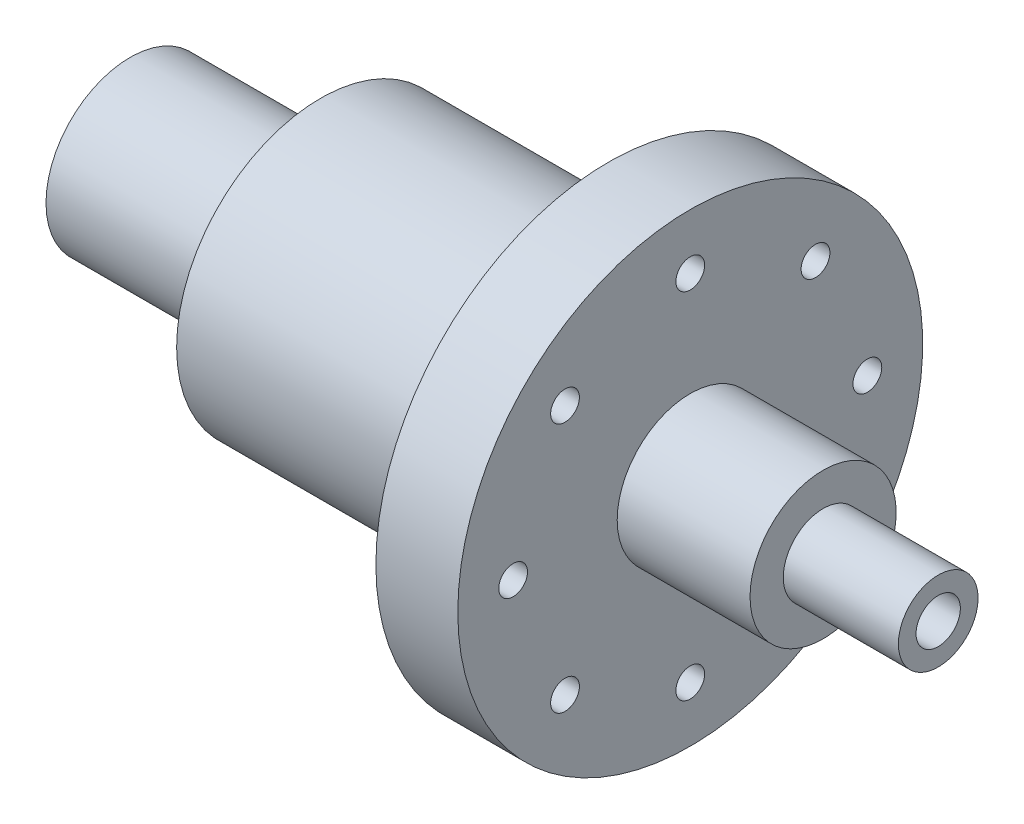
ISO-10303-21;
HEADER;
FILE_DESCRIPTION(('STEP AP214'),'2;1');
FILE_NAME('part.step','',(''),(''),'','','');
FILE_SCHEMA(('AUTOMOTIVE_DESIGN { 1 0 10303 214 1 1 1 1 }'));
ENDSEC;
DATA;
#1=APPLICATION_CONTEXT('core data for automotive mechanical design processes');
#2=APPLICATION_PROTOCOL_DEFINITION('international standard','automotive_design',2000,#1);
#3=PRODUCT_CONTEXT('',#1,'mechanical');
#4=PRODUCT('Part','Part','',(#3));
#5=PRODUCT_RELATED_PRODUCT_CATEGORY('part','',(#4));
#6=PRODUCT_DEFINITION_FORMATION('','',#4);
#7=PRODUCT_DEFINITION_CONTEXT('part definition',#1,'design');
#8=PRODUCT_DEFINITION('design','',#6,#7);
#9=PRODUCT_DEFINITION_SHAPE('','',#8);
#10=(LENGTH_UNIT() NAMED_UNIT(*) SI_UNIT(.MILLI.,.METRE.));
#11=(NAMED_UNIT(*) PLANE_ANGLE_UNIT() SI_UNIT($,.RADIAN.));
#12=(NAMED_UNIT(*) SI_UNIT($,.STERADIAN.) SOLID_ANGLE_UNIT());
#13=UNCERTAINTY_MEASURE_WITH_UNIT(LENGTH_MEASURE(1.E-05),#10,'distance_accuracy_value','');
#14=(GEOMETRIC_REPRESENTATION_CONTEXT(3) GLOBAL_UNCERTAINTY_ASSIGNED_CONTEXT((#13)) GLOBAL_UNIT_ASSIGNED_CONTEXT((#10,
#11,#12)) REPRESENTATION_CONTEXT('',''));
#15=CARTESIAN_POINT('',(0.,0.,0.));
#16=DIRECTION('',(0.,0.,1.));
#17=DIRECTION('',(1.,0.,0.));
#18=AXIS2_PLACEMENT_3D('',#15,#16,#17);
#19=CARTESIAN_POINT('',(-194.06956615453,0.,0.));
#20=DIRECTION('',(-1.,0.,0.));
#21=DIRECTION('',(0.,0.,1.));
#22=AXIS2_PLACEMENT_3D('',#19,#20,#21);
#23=CYLINDRICAL_SURFACE('',#22,9.99999999999998);
#24=CARTESIAN_POINT('',(182.5,0.,0.));
#25=DIRECTION('',(-1.,0.,0.));
#26=DIRECTION('',(0.,0.,1.));
#27=AXIS2_PLACEMENT_3D('',#24,#25,#26);
#28=CIRCLE('',#27,9.99999999999998);
#29=CARTESIAN_POINT('',(182.5,0.,9.99999999999998));
#30=VERTEX_POINT('',#29);
#31=EDGE_CURVE('E87',#30,#30,#28,.T.);
#32=ORIENTED_EDGE('',*,*,#31,.F.);
#33=EDGE_LOOP('',(#32));
#34=FACE_BOUND('',#33,.T.);
#35=CARTESIAN_POINT('',(-182.5,0.,0.));
#36=DIRECTION('',(-1.,0.,0.));
#37=DIRECTION('',(0.,0.,1.));
#38=AXIS2_PLACEMENT_3D('',#35,#36,#37);
#39=CIRCLE('',#38,9.99999999999998);
#40=CARTESIAN_POINT('',(-182.5,0.,9.99999999999998));
#41=VERTEX_POINT('',#40);
#42=EDGE_CURVE('E12',#41,#41,#39,.T.);
#43=ORIENTED_EDGE('',*,*,#42,.T.);
#44=EDGE_LOOP('',(#43));
#45=FACE_BOUND('',#44,.T.);
#46=ADVANCED_FACE('F47',(#34,#45),#23,.F.);
#47=CARTESIAN_POINT('',(-182.5,9.99999999999998,0.));
#48=DIRECTION('',(1.,0.,0.));
#49=DIRECTION('',(0.,0.,-1.));
#50=AXIS2_PLACEMENT_3D('',#47,#48,#49);
#51=PLANE('',#50);
#52=ORIENTED_EDGE('',*,*,#42,.F.);
#53=EDGE_LOOP('',(#52));
#54=FACE_BOUND('',#53,.T.);
#55=CARTESIAN_POINT('',(-182.5,0.,0.));
#56=DIRECTION('',(-1.,0.,0.));
#57=DIRECTION('',(0.,0.,1.));
#58=AXIS2_PLACEMENT_3D('',#55,#56,#57);
#59=CIRCLE('',#58,38.);
#60=CARTESIAN_POINT('',(-182.5,0.,38.));
#61=VERTEX_POINT('',#60);
#62=EDGE_CURVE('E53',#61,#61,#59,.T.);
#63=ORIENTED_EDGE('',*,*,#62,.T.);
#64=EDGE_LOOP('',(#63));
#65=FACE_BOUND('',#64,.T.);
#66=ADVANCED_FACE('F191',(#54,#65),#51,.F.);
#67=CARTESIAN_POINT('',(-194.06956615453,0.,0.));
#68=DIRECTION('',(-1.,0.,0.));
#69=DIRECTION('',(0.,0.,1.));
#70=AXIS2_PLACEMENT_3D('',#67,#68,#69);
#71=CYLINDRICAL_SURFACE('',#70,38.);
#72=ORIENTED_EDGE('',*,*,#62,.F.);
#73=EDGE_LOOP('',(#72));
#74=FACE_BOUND('',#73,.T.);
#75=CARTESIAN_POINT('',(-96.5,0.,0.));
#76=DIRECTION('',(-1.,0.,0.));
#77=DIRECTION('',(0.,0.,1.));
#78=AXIS2_PLACEMENT_3D('',#75,#76,#77);
#79=CIRCLE('',#78,38.);
#80=CARTESIAN_POINT('',(-96.5,0.,38.));
#81=VERTEX_POINT('',#80);
#82=EDGE_CURVE('E57',#81,#81,#79,.T.);
#83=ORIENTED_EDGE('',*,*,#82,.T.);
#84=EDGE_LOOP('',(#83));
#85=FACE_BOUND('',#84,.T.);
#86=ADVANCED_FACE('F195',(#74,#85),#71,.T.);
#87=CARTESIAN_POINT('',(-96.5,38.,0.));
#88=DIRECTION('',(1.,0.,0.));
#89=DIRECTION('',(0.,0.,-1.));
#90=AXIS2_PLACEMENT_3D('',#87,#88,#89);
#91=PLANE('',#90);
#92=ORIENTED_EDGE('',*,*,#82,.F.);
#93=EDGE_LOOP('',(#92));
#94=FACE_BOUND('',#93,.T.);
#95=CARTESIAN_POINT('',(-96.5,0.,0.));
#96=DIRECTION('',(-1.,0.,0.));
#97=DIRECTION('',(0.,0.,1.));
#98=AXIS2_PLACEMENT_3D('',#95,#96,#97);
#99=CIRCLE('',#98,65.);
#100=CARTESIAN_POINT('',(-96.5,0.,65.));
#101=VERTEX_POINT('',#100);
#102=EDGE_CURVE('E61',#101,#101,#99,.T.);
#103=ORIENTED_EDGE('',*,*,#102,.T.);
#104=EDGE_LOOP('',(#103));
#105=FACE_BOUND('',#104,.T.);
#106=ADVANCED_FACE('F200',(#94,#105),#91,.F.);
#107=CARTESIAN_POINT('',(-194.06956615453,0.,0.));
#108=DIRECTION('',(-1.,0.,0.));
#109=DIRECTION('',(0.,0.,1.));
#110=AXIS2_PLACEMENT_3D('',#107,#108,#109);
#111=CYLINDRICAL_SURFACE('',#110,65.);
#112=ORIENTED_EDGE('',*,*,#102,.F.);
#113=EDGE_LOOP('',(#112));
#114=FACE_BOUND('',#113,.T.);
#115=CARTESIAN_POINT('',(33.5,0.,0.));
#116=DIRECTION('',(-1.,0.,0.));
#117=DIRECTION('',(0.,0.,1.));
#118=AXIS2_PLACEMENT_3D('',#115,#116,#117);
#119=CIRCLE('',#118,65.);
#120=CARTESIAN_POINT('',(33.5,0.,65.));
#121=VERTEX_POINT('',#120);
#122=EDGE_CURVE('E66',#121,#121,#119,.T.);
#123=ORIENTED_EDGE('',*,*,#122,.T.);
#124=EDGE_LOOP('',(#123));
#125=FACE_BOUND('',#124,.T.);
#126=ADVANCED_FACE('F206',(#114,#125),#111,.T.);
#127=CARTESIAN_POINT('',(33.5,65.,0.));
#128=DIRECTION('',(1.,0.,0.));
#129=DIRECTION('',(0.,0.,-1.));
#130=AXIS2_PLACEMENT_3D('',#127,#128,#129);
#131=PLANE('',#130);
#132=CARTESIAN_POINT('',(33.5,80.,-1.46726526693321E-12));
#133=DIRECTION('',(1.,0.,0.));
#134=DIRECTION('',(0.,0.,-1.));
#135=AXIS2_PLACEMENT_3D('',#132,#133,#134);
#136=CIRCLE('',#135,6.5);
#137=CARTESIAN_POINT('',(33.5,80.,-6.50000000000147));
#138=VERTEX_POINT('',#137);
#139=EDGE_CURVE('E90',#138,#138,#136,.T.);
#140=ORIENTED_EDGE('',*,*,#139,.T.);
#141=EDGE_LOOP('',(#140));
#142=FACE_BOUND('',#141,.T.);
#143=CARTESIAN_POINT('',(33.5,56.5685424949262,-56.5685424949263));
#144=DIRECTION('',(1.,0.,0.));
#145=DIRECTION('',(0.,0.,-1.));
#146=AXIS2_PLACEMENT_3D('',#143,#144,#145);
#147=CIRCLE('',#146,6.5);
#148=CARTESIAN_POINT('',(33.5,56.5685424949262,-63.0685424949263));
#149=VERTEX_POINT('',#148);
#150=EDGE_CURVE('E93',#149,#149,#147,.T.);
#151=ORIENTED_EDGE('',*,*,#150,.T.);
#152=EDGE_LOOP('',(#151));
#153=FACE_BOUND('',#152,.T.);
#154=CARTESIAN_POINT('',(33.5,3.4008079572553E-12,-80.0000000000049));
#155=DIRECTION('',(1.,0.,0.));
#156=DIRECTION('',(0.,0.,-1.));
#157=AXIS2_PLACEMENT_3D('',#154,#155,#156);
#158=CIRCLE('',#157,6.5);
#159=CARTESIAN_POINT('',(33.5,3.4008079572553E-12,-86.5000000000049));
#160=VERTEX_POINT('',#159);
#161=EDGE_CURVE('E96',#160,#160,#158,.T.);
#162=ORIENTED_EDGE('',*,*,#161,.T.);
#163=EDGE_LOOP('',(#162));
#164=FACE_BOUND('',#163,.T.);
#165=CARTESIAN_POINT('',(33.5,-56.5685424949214,-56.5685424949311));
#166=DIRECTION('',(1.,0.,0.));
#167=DIRECTION('',(0.,0.,-1.));
#168=AXIS2_PLACEMENT_3D('',#165,#166,#167);
#169=CIRCLE('',#168,6.5);
#170=CARTESIAN_POINT('',(33.5,-56.5685424949214,-63.0685424949311));
#171=VERTEX_POINT('',#170);
#172=EDGE_CURVE('E99',#171,#171,#169,.T.);
#173=ORIENTED_EDGE('',*,*,#172,.T.);
#174=EDGE_LOOP('',(#173));
#175=FACE_BOUND('',#174,.T.);
#176=CARTESIAN_POINT('',(33.5,-80.,-8.26888118144381E-12));
#177=DIRECTION('',(1.,0.,0.));
#178=DIRECTION('',(0.,0.,-1.));
#179=AXIS2_PLACEMENT_3D('',#176,#177,#178);
#180=CIRCLE('',#179,6.5);
#181=CARTESIAN_POINT('',(33.5,-80.,-6.50000000000827));
#182=VERTEX_POINT('',#181);
#183=EDGE_CURVE('E102',#182,#182,#180,.T.);
#184=ORIENTED_EDGE('',*,*,#183,.T.);
#185=EDGE_LOOP('',(#184));
#186=FACE_BOUND('',#185,.T.);
#187=CARTESIAN_POINT('',(33.5,-56.5685424949262,56.5685424949165));
#188=DIRECTION('',(1.,0.,0.));
#189=DIRECTION('',(0.,0.,-1.));
#190=AXIS2_PLACEMENT_3D('',#187,#188,#189);
#191=CIRCLE('',#190,6.50000000000001);
#192=CARTESIAN_POINT('',(33.5,-56.5685424949262,50.0685424949165));
#193=VERTEX_POINT('',#192);
#194=EDGE_CURVE('E105',#193,#193,#191,.T.);
#195=ORIENTED_EDGE('',*,*,#194,.T.);
#196=EDGE_LOOP('',(#195));
#197=FACE_BOUND('',#196,.T.);
#198=CARTESIAN_POINT('',(33.5,-3.41060513164848E-12,79.9999999999951));
#199=DIRECTION('',(1.,0.,0.));
#200=DIRECTION('',(0.,0.,-1.));
#201=AXIS2_PLACEMENT_3D('',#198,#199,#200);
#202=CIRCLE('',#201,6.5);
#203=CARTESIAN_POINT('',(33.5,-3.41060513164848E-12,73.4999999999951));
#204=VERTEX_POINT('',#203);
#205=EDGE_CURVE('E108',#204,#204,#202,.T.);
#206=ORIENTED_EDGE('',*,*,#205,.T.);
#207=EDGE_LOOP('',(#206));
#208=FACE_BOUND('',#207,.T.);
#209=CARTESIAN_POINT('',(33.5,56.5685424949214,56.5685424949213));
#210=DIRECTION('',(1.,0.,0.));
#211=DIRECTION('',(0.,0.,-1.));
#212=AXIS2_PLACEMENT_3D('',#209,#210,#211);
#213=CIRCLE('',#212,6.50000000000001);
#214=CARTESIAN_POINT('',(33.5,56.5685424949214,50.0685424949213));
#215=VERTEX_POINT('',#214);
#216=EDGE_CURVE('E111',#215,#215,#213,.T.);
#217=ORIENTED_EDGE('',*,*,#216,.T.);
#218=EDGE_LOOP('',(#217));
#219=FACE_BOUND('',#218,.T.);
#220=ORIENTED_EDGE('',*,*,#122,.F.);
#221=EDGE_LOOP('',(#220));
#222=FACE_BOUND('',#221,.T.);
#223=CARTESIAN_POINT('',(33.5,0.,0.));
#224=DIRECTION('',(-1.,0.,0.));
#225=DIRECTION('',(0.,0.,1.));
#226=AXIS2_PLACEMENT_3D('',#223,#224,#225);
#227=CIRCLE('',#226,105.);
#228=CARTESIAN_POINT('',(33.5,0.,105.));
#229=VERTEX_POINT('',#228);
#230=EDGE_CURVE('E69',#229,#229,#227,.T.);
#231=ORIENTED_EDGE('',*,*,#230,.T.);
#232=EDGE_LOOP('',(#231));
#233=FACE_BOUND('',#232,.T.);
#234=ADVANCED_FACE('F210',(#142,#153,#164,#175,#186,#197,#208,#219,#222,#233),#131,.F.);
#235=CARTESIAN_POINT('',(-194.06956615453,0.,0.));
#236=DIRECTION('',(-1.,0.,0.));
#237=DIRECTION('',(0.,0.,1.));
#238=AXIS2_PLACEMENT_3D('',#235,#236,#237);
#239=CYLINDRICAL_SURFACE('',#238,105.);
#240=ORIENTED_EDGE('',*,*,#230,.F.);
#241=EDGE_LOOP('',(#240));
#242=FACE_BOUND('',#241,.T.);
#243=CARTESIAN_POINT('',(70.5,0.,0.));
#244=DIRECTION('',(-1.,0.,0.));
#245=DIRECTION('',(0.,0.,1.));
#246=AXIS2_PLACEMENT_3D('',#243,#244,#245);
#247=CIRCLE('',#246,105.);
#248=CARTESIAN_POINT('',(70.5,0.,105.));
#249=VERTEX_POINT('',#248);
#250=EDGE_CURVE('E72',#249,#249,#247,.T.);
#251=ORIENTED_EDGE('',*,*,#250,.T.);
#252=EDGE_LOOP('',(#251));
#253=FACE_BOUND('',#252,.T.);
#254=ADVANCED_FACE('F146',(#242,#253),#239,.T.);
#255=CARTESIAN_POINT('',(70.5,105.,0.));
#256=DIRECTION('',(-1.,0.,0.));
#257=DIRECTION('',(0.,0.,1.));
#258=AXIS2_PLACEMENT_3D('',#255,#256,#257);
#259=PLANE('',#258);
#260=CARTESIAN_POINT('',(70.5,80.,-1.46726526693321E-12));
#261=DIRECTION('',(1.,0.,0.));
#262=DIRECTION('',(0.,0.,-1.));
#263=AXIS2_PLACEMENT_3D('',#260,#261,#262);
#264=CIRCLE('',#263,6.5);
#265=CARTESIAN_POINT('',(70.5,80.,-6.50000000000147));
#266=VERTEX_POINT('',#265);
#267=EDGE_CURVE('E114',#266,#266,#264,.T.);
#268=ORIENTED_EDGE('',*,*,#267,.F.);
#269=EDGE_LOOP('',(#268));
#270=FACE_BOUND('',#269,.T.);
#271=CARTESIAN_POINT('',(70.5,56.5685424949262,-56.5685424949263));
#272=DIRECTION('',(1.,0.,0.));
#273=DIRECTION('',(0.,0.,-1.));
#274=AXIS2_PLACEMENT_3D('',#271,#272,#273);
#275=CIRCLE('',#274,6.5);
#276=CARTESIAN_POINT('',(70.5,56.5685424949262,-63.0685424949263));
#277=VERTEX_POINT('',#276);
#278=EDGE_CURVE('E133',#277,#277,#275,.T.);
#279=ORIENTED_EDGE('',*,*,#278,.F.);
#280=EDGE_LOOP('',(#279));
#281=FACE_BOUND('',#280,.T.);
#282=CARTESIAN_POINT('',(70.5,3.4008079572553E-12,-80.0000000000049));
#283=DIRECTION('',(1.,0.,0.));
#284=DIRECTION('',(0.,0.,-1.));
#285=AXIS2_PLACEMENT_3D('',#282,#283,#284);
#286=CIRCLE('',#285,6.5);
#287=CARTESIAN_POINT('',(70.5,3.4008079572553E-12,-86.5000000000049));
#288=VERTEX_POINT('',#287);
#289=EDGE_CURVE('E130',#288,#288,#286,.T.);
#290=ORIENTED_EDGE('',*,*,#289,.F.);
#291=EDGE_LOOP('',(#290));
#292=FACE_BOUND('',#291,.T.);
#293=CARTESIAN_POINT('',(70.5,-56.5685424949214,-56.5685424949311));
#294=DIRECTION('',(1.,0.,0.));
#295=DIRECTION('',(0.,0.,-1.));
#296=AXIS2_PLACEMENT_3D('',#293,#294,#295);
#297=CIRCLE('',#296,6.5);
#298=CARTESIAN_POINT('',(70.5,-56.5685424949214,-63.0685424949311));
#299=VERTEX_POINT('',#298);
#300=EDGE_CURVE('E127',#299,#299,#297,.T.);
#301=ORIENTED_EDGE('',*,*,#300,.F.);
#302=EDGE_LOOP('',(#301));
#303=FACE_BOUND('',#302,.T.);
#304=CARTESIAN_POINT('',(70.5,-80.,-8.26888118144381E-12));
#305=DIRECTION('',(1.,0.,0.));
#306=DIRECTION('',(0.,0.,-1.));
#307=AXIS2_PLACEMENT_3D('',#304,#305,#306);
#308=CIRCLE('',#307,6.5);
#309=CARTESIAN_POINT('',(70.5,-80.,-6.50000000000827));
#310=VERTEX_POINT('',#309);
#311=EDGE_CURVE('E124',#310,#310,#308,.T.);
#312=ORIENTED_EDGE('',*,*,#311,.F.);
#313=EDGE_LOOP('',(#312));
#314=FACE_BOUND('',#313,.T.);
#315=CARTESIAN_POINT('',(70.5,-56.5685424949262,56.5685424949165));
#316=DIRECTION('',(1.,0.,0.));
#317=DIRECTION('',(0.,0.,-1.));
#318=AXIS2_PLACEMENT_3D('',#315,#316,#317);
#319=CIRCLE('',#318,6.50000000000001);
#320=CARTESIAN_POINT('',(70.5,-56.5685424949262,50.0685424949165));
#321=VERTEX_POINT('',#320);
#322=EDGE_CURVE('E121',#321,#321,#319,.T.);
#323=ORIENTED_EDGE('',*,*,#322,.F.);
#324=EDGE_LOOP('',(#323));
#325=FACE_BOUND('',#324,.T.);
#326=CARTESIAN_POINT('',(70.5,-3.41060513164848E-12,79.9999999999951));
#327=DIRECTION('',(1.,0.,0.));
#328=DIRECTION('',(0.,0.,-1.));
#329=AXIS2_PLACEMENT_3D('',#326,#327,#328);
#330=CIRCLE('',#329,6.5);
#331=CARTESIAN_POINT('',(70.5,-3.41060513164848E-12,73.4999999999951));
#332=VERTEX_POINT('',#331);
#333=EDGE_CURVE('E118',#332,#332,#330,.T.);
#334=ORIENTED_EDGE('',*,*,#333,.F.);
#335=EDGE_LOOP('',(#334));
#336=FACE_BOUND('',#335,.T.);
#337=CARTESIAN_POINT('',(70.5,56.5685424949214,56.5685424949213));
#338=DIRECTION('',(1.,0.,0.));
#339=DIRECTION('',(0.,0.,-1.));
#340=AXIS2_PLACEMENT_3D('',#337,#338,#339);
#341=CIRCLE('',#340,6.50000000000001);
#342=CARTESIAN_POINT('',(70.5,56.5685424949214,50.0685424949213));
#343=VERTEX_POINT('',#342);
#344=EDGE_CURVE('E115',#343,#343,#341,.T.);
#345=ORIENTED_EDGE('',*,*,#344,.F.);
#346=EDGE_LOOP('',(#345));
#347=FACE_BOUND('',#346,.T.);
#348=ORIENTED_EDGE('',*,*,#250,.F.);
#349=EDGE_LOOP('',(#348));
#350=FACE_BOUND('',#349,.T.);
#351=CARTESIAN_POINT('',(70.5,0.,0.));
#352=DIRECTION('',(-1.,0.,0.));
#353=DIRECTION('',(0.,0.,1.));
#354=AXIS2_PLACEMENT_3D('',#351,#352,#353);
#355=CIRCLE('',#354,33.);
#356=CARTESIAN_POINT('',(70.5,0.,33.));
#357=VERTEX_POINT('',#356);
#358=EDGE_CURVE('E75',#357,#357,#355,.T.);
#359=ORIENTED_EDGE('',*,*,#358,.T.);
#360=EDGE_LOOP('',(#359));
#361=FACE_BOUND('',#360,.T.);
#362=ADVANCED_FACE('F142',(#270,#281,#292,#303,#314,#325,#336,#347,#350,#361),#259,.F.);
#363=CARTESIAN_POINT('',(-194.06956615453,0.,0.));
#364=DIRECTION('',(-1.,0.,0.));
#365=DIRECTION('',(0.,0.,1.));
#366=AXIS2_PLACEMENT_3D('',#363,#364,#365);
#367=CYLINDRICAL_SURFACE('',#366,33.);
#368=ORIENTED_EDGE('',*,*,#358,.F.);
#369=EDGE_LOOP('',(#368));
#370=FACE_BOUND('',#369,.T.);
#371=CARTESIAN_POINT('',(130.5,0.,0.));
#372=DIRECTION('',(-1.,0.,0.));
#373=DIRECTION('',(0.,0.,1.));
#374=AXIS2_PLACEMENT_3D('',#371,#372,#373);
#375=CIRCLE('',#374,33.);
#376=CARTESIAN_POINT('',(130.5,0.,33.));
#377=VERTEX_POINT('',#376);
#378=EDGE_CURVE('E78',#377,#377,#375,.T.);
#379=ORIENTED_EDGE('',*,*,#378,.T.);
#380=EDGE_LOOP('',(#379));
#381=FACE_BOUND('',#380,.T.);
#382=ADVANCED_FACE('F145',(#370,#381),#367,.T.);
#383=CARTESIAN_POINT('',(130.5,33.,0.));
#384=DIRECTION('',(-1.,0.,0.));
#385=DIRECTION('',(0.,0.,1.));
#386=AXIS2_PLACEMENT_3D('',#383,#384,#385);
#387=PLANE('',#386);
#388=ORIENTED_EDGE('',*,*,#378,.F.);
#389=EDGE_LOOP('',(#388));
#390=FACE_BOUND('',#389,.T.);
#391=CARTESIAN_POINT('',(130.5,0.,0.));
#392=DIRECTION('',(-1.,0.,0.));
#393=DIRECTION('',(0.,0.,1.));
#394=AXIS2_PLACEMENT_3D('',#391,#392,#393);
#395=CIRCLE('',#394,18.);
#396=CARTESIAN_POINT('',(130.5,0.,18.));
#397=VERTEX_POINT('',#396);
#398=EDGE_CURVE('E81',#397,#397,#395,.T.);
#399=ORIENTED_EDGE('',*,*,#398,.T.);
#400=EDGE_LOOP('',(#399));
#401=FACE_BOUND('',#400,.T.);
#402=ADVANCED_FACE('F168',(#390,#401),#387,.F.);
#403=CARTESIAN_POINT('',(-194.06956615453,0.,0.));
#404=DIRECTION('',(-1.,0.,0.));
#405=DIRECTION('',(0.,0.,1.));
#406=AXIS2_PLACEMENT_3D('',#403,#404,#405);
#407=CYLINDRICAL_SURFACE('',#406,18.);
#408=ORIENTED_EDGE('',*,*,#398,.F.);
#409=EDGE_LOOP('',(#408));
#410=FACE_BOUND('',#409,.T.);
#411=CARTESIAN_POINT('',(182.5,0.,0.));
#412=DIRECTION('',(-1.,0.,0.));
#413=DIRECTION('',(0.,0.,1.));
#414=AXIS2_PLACEMENT_3D('',#411,#412,#413);
#415=CIRCLE('',#414,18.);
#416=CARTESIAN_POINT('',(182.5,0.,18.));
#417=VERTEX_POINT('',#416);
#418=EDGE_CURVE('E84',#417,#417,#415,.T.);
#419=ORIENTED_EDGE('',*,*,#418,.T.);
#420=EDGE_LOOP('',(#419));
#421=FACE_BOUND('',#420,.T.);
#422=ADVANCED_FACE('F174',(#410,#421),#407,.T.);
#423=CARTESIAN_POINT('',(182.5,18.,0.));
#424=DIRECTION('',(-1.,0.,0.));
#425=DIRECTION('',(0.,0.,1.));
#426=AXIS2_PLACEMENT_3D('',#423,#424,#425);
#427=PLANE('',#426);
#428=ORIENTED_EDGE('',*,*,#418,.F.);
#429=EDGE_LOOP('',(#428));
#430=FACE_BOUND('',#429,.T.);
#431=ORIENTED_EDGE('',*,*,#31,.T.);
#432=EDGE_LOOP('',(#431));
#433=FACE_BOUND('',#432,.T.);
#434=ADVANCED_FACE('F180',(#430,#433),#427,.F.);
#435=CARTESIAN_POINT('',(-182.5,56.5685424949214,56.5685424949213));
#436=DIRECTION('',(1.,0.,0.));
#437=DIRECTION('',(0.,0.,-1.));
#438=AXIS2_PLACEMENT_3D('',#435,#436,#437);
#439=CYLINDRICAL_SURFACE('',#438,6.50000000000001);
#440=ORIENTED_EDGE('',*,*,#344,.T.);
#441=EDGE_LOOP('',(#440));
#442=FACE_BOUND('',#441,.T.);
#443=ORIENTED_EDGE('',*,*,#216,.F.);
#444=EDGE_LOOP('',(#443));
#445=FACE_BOUND('',#444,.T.);
#446=ADVANCED_FACE('F186',(#442,#445),#439,.F.);
#447=CARTESIAN_POINT('',(-182.5,-3.41060513164848E-12,79.9999999999951));
#448=DIRECTION('',(1.,0.,0.));
#449=DIRECTION('',(0.,0.,-1.));
#450=AXIS2_PLACEMENT_3D('',#447,#448,#449);
#451=CYLINDRICAL_SURFACE('',#450,6.5);
#452=ORIENTED_EDGE('',*,*,#333,.T.);
#453=EDGE_LOOP('',(#452));
#454=FACE_BOUND('',#453,.T.);
#455=ORIENTED_EDGE('',*,*,#205,.F.);
#456=EDGE_LOOP('',(#455));
#457=FACE_BOUND('',#456,.T.);
#458=ADVANCED_FACE('F220',(#454,#457),#451,.F.);
#459=CARTESIAN_POINT('',(-182.5,-56.5685424949262,56.5685424949165));
#460=DIRECTION('',(1.,0.,0.));
#461=DIRECTION('',(0.,0.,-1.));
#462=AXIS2_PLACEMENT_3D('',#459,#460,#461);
#463=CYLINDRICAL_SURFACE('',#462,6.50000000000001);
#464=ORIENTED_EDGE('',*,*,#322,.T.);
#465=EDGE_LOOP('',(#464));
#466=FACE_BOUND('',#465,.T.);
#467=ORIENTED_EDGE('',*,*,#194,.F.);
#468=EDGE_LOOP('',(#467));
#469=FACE_BOUND('',#468,.T.);
#470=ADVANCED_FACE('F224',(#466,#469),#463,.F.);
#471=CARTESIAN_POINT('',(-182.5,-80.,-8.26888118144381E-12));
#472=DIRECTION('',(1.,0.,0.));
#473=DIRECTION('',(0.,0.,-1.));
#474=AXIS2_PLACEMENT_3D('',#471,#472,#473);
#475=CYLINDRICAL_SURFACE('',#474,6.5);
#476=ORIENTED_EDGE('',*,*,#311,.T.);
#477=EDGE_LOOP('',(#476));
#478=FACE_BOUND('',#477,.T.);
#479=ORIENTED_EDGE('',*,*,#183,.F.);
#480=EDGE_LOOP('',(#479));
#481=FACE_BOUND('',#480,.T.);
#482=ADVANCED_FACE('F228',(#478,#481),#475,.F.);
#483=CARTESIAN_POINT('',(-182.5,-56.5685424949214,-56.5685424949311));
#484=DIRECTION('',(1.,0.,0.));
#485=DIRECTION('',(0.,0.,-1.));
#486=AXIS2_PLACEMENT_3D('',#483,#484,#485);
#487=CYLINDRICAL_SURFACE('',#486,6.5);
#488=ORIENTED_EDGE('',*,*,#300,.T.);
#489=EDGE_LOOP('',(#488));
#490=FACE_BOUND('',#489,.T.);
#491=ORIENTED_EDGE('',*,*,#172,.F.);
#492=EDGE_LOOP('',(#491));
#493=FACE_BOUND('',#492,.T.);
#494=ADVANCED_FACE('F232',(#490,#493),#487,.F.);
#495=CARTESIAN_POINT('',(-182.5,3.4008079572553E-12,-80.0000000000049));
#496=DIRECTION('',(1.,0.,0.));
#497=DIRECTION('',(0.,0.,-1.));
#498=AXIS2_PLACEMENT_3D('',#495,#496,#497);
#499=CYLINDRICAL_SURFACE('',#498,6.5);
#500=ORIENTED_EDGE('',*,*,#289,.T.);
#501=EDGE_LOOP('',(#500));
#502=FACE_BOUND('',#501,.T.);
#503=ORIENTED_EDGE('',*,*,#161,.F.);
#504=EDGE_LOOP('',(#503));
#505=FACE_BOUND('',#504,.T.);
#506=ADVANCED_FACE('F236',(#502,#505),#499,.F.);
#507=CARTESIAN_POINT('',(-182.5,56.5685424949262,-56.5685424949263));
#508=DIRECTION('',(1.,0.,0.));
#509=DIRECTION('',(0.,0.,-1.));
#510=AXIS2_PLACEMENT_3D('',#507,#508,#509);
#511=CYLINDRICAL_SURFACE('',#510,6.5);
#512=ORIENTED_EDGE('',*,*,#278,.T.);
#513=EDGE_LOOP('',(#512));
#514=FACE_BOUND('',#513,.T.);
#515=ORIENTED_EDGE('',*,*,#150,.F.);
#516=EDGE_LOOP('',(#515));
#517=FACE_BOUND('',#516,.T.);
#518=ADVANCED_FACE('F240',(#514,#517),#511,.F.);
#519=CARTESIAN_POINT('',(-182.5,80.,-1.46726526693321E-12));
#520=DIRECTION('',(1.,0.,0.));
#521=DIRECTION('',(0.,0.,-1.));
#522=AXIS2_PLACEMENT_3D('',#519,#520,#521);
#523=CYLINDRICAL_SURFACE('',#522,6.5);
#524=ORIENTED_EDGE('',*,*,#267,.T.);
#525=EDGE_LOOP('',(#524));
#526=FACE_BOUND('',#525,.T.);
#527=ORIENTED_EDGE('',*,*,#139,.F.);
#528=EDGE_LOOP('',(#527));
#529=FACE_BOUND('',#528,.T.);
#530=ADVANCED_FACE('F139',(#526,#529),#523,.F.);
#531=CLOSED_SHELL('',(#46,#66,#86,#106,#126,#234,#254,#362,#382,#402,#422,#434,#446,#458,#470,
#482,#494,#506,#518,#530));
#532=MANIFOLD_SOLID_BREP('B2',#531);
#533=ADVANCED_BREP_SHAPE_REPRESENTATION('',(#18,#532),#14);
#534=SHAPE_DEFINITION_REPRESENTATION(#9,#533);
ENDSEC;
END-ISO-10303-21;
